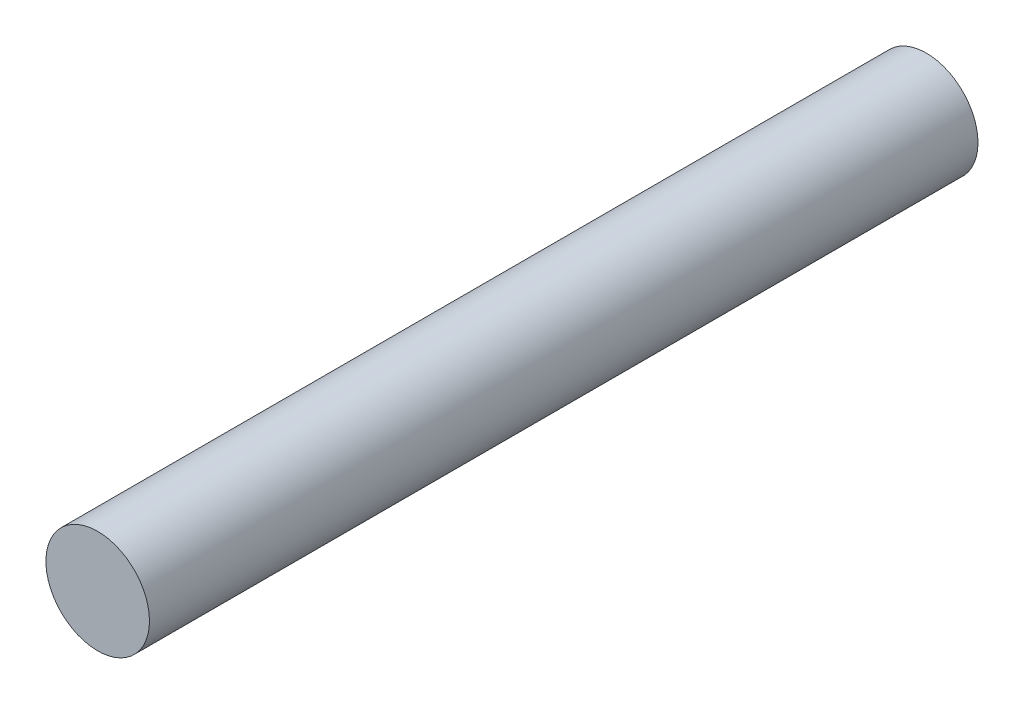
ISO-10303-21;
HEADER;
FILE_DESCRIPTION(('STEP AP214'),'2;1');
FILE_NAME('part.step','',(''),(''),'','','');
FILE_SCHEMA(('AUTOMOTIVE_DESIGN { 1 0 10303 214 1 1 1 1 }'));
ENDSEC;
DATA;
#1=APPLICATION_CONTEXT('core data for automotive mechanical design processes');
#2=APPLICATION_PROTOCOL_DEFINITION('international standard','automotive_design',2000,#1);
#3=PRODUCT_CONTEXT('',#1,'mechanical');
#4=PRODUCT('Part','Part','',(#3));
#5=PRODUCT_RELATED_PRODUCT_CATEGORY('part','',(#4));
#6=PRODUCT_DEFINITION_FORMATION('','',#4);
#7=PRODUCT_DEFINITION_CONTEXT('part definition',#1,'design');
#8=PRODUCT_DEFINITION('design','',#6,#7);
#9=PRODUCT_DEFINITION_SHAPE('','',#8);
#10=(LENGTH_UNIT() NAMED_UNIT(*) SI_UNIT(.MILLI.,.METRE.));
#11=(NAMED_UNIT(*) PLANE_ANGLE_UNIT() SI_UNIT($,.RADIAN.));
#12=(NAMED_UNIT(*) SI_UNIT($,.STERADIAN.) SOLID_ANGLE_UNIT());
#13=UNCERTAINTY_MEASURE_WITH_UNIT(LENGTH_MEASURE(1.E-05),#10,'distance_accuracy_value','');
#14=(GEOMETRIC_REPRESENTATION_CONTEXT(3) GLOBAL_UNCERTAINTY_ASSIGNED_CONTEXT((#13)) GLOBAL_UNIT_ASSIGNED_CONTEXT((#10,
#11,#12)) REPRESENTATION_CONTEXT('',''));
#15=CARTESIAN_POINT('',(0.,0.,0.));
#16=DIRECTION('',(0.,0.,1.));
#17=DIRECTION('',(1.,0.,0.));
#18=AXIS2_PLACEMENT_3D('',#15,#16,#17);
#19=CARTESIAN_POINT('',(0.,0.,-76.2));
#20=DIRECTION('',(0.,0.,1.));
#21=DIRECTION('',(1.,0.,0.));
#22=AXIS2_PLACEMENT_3D('',#19,#20,#21);
#23=CYLINDRICAL_SURFACE('',#22,4.7625);
#24=CARTESIAN_POINT('',(0.,0.,-76.2));
#25=DIRECTION('',(0.,0.,1.));
#26=DIRECTION('',(1.,0.,0.));
#27=AXIS2_PLACEMENT_3D('',#24,#25,#26);
#28=CIRCLE('',#27,4.7625);
#29=CARTESIAN_POINT('',(4.7625,0.,-76.2));
#30=VERTEX_POINT('',#29);
#31=EDGE_CURVE('E10',#30,#30,#28,.T.);
#32=ORIENTED_EDGE('',*,*,#31,.T.);
#33=EDGE_LOOP('',(#32));
#34=FACE_BOUND('',#33,.T.);
#35=CARTESIAN_POINT('',(0.,0.,0.));
#36=DIRECTION('',(0.,0.,1.));
#37=DIRECTION('',(1.,0.,0.));
#38=AXIS2_PLACEMENT_3D('',#35,#36,#37);
#39=CIRCLE('',#38,4.7625);
#40=CARTESIAN_POINT('',(4.7625,0.,0.));
#41=VERTEX_POINT('',#40);
#42=EDGE_CURVE('E40',#41,#41,#39,.T.);
#43=ORIENTED_EDGE('',*,*,#42,.F.);
#44=EDGE_LOOP('',(#43));
#45=FACE_BOUND('',#44,.T.);
#46=ADVANCED_FACE('F37',(#34,#45),#23,.T.);
#47=CARTESIAN_POINT('',(0.,0.,-76.2));
#48=DIRECTION('',(0.,0.,1.));
#49=DIRECTION('',(1.,0.,0.));
#50=AXIS2_PLACEMENT_3D('',#47,#48,#49);
#51=PLANE('',#50);
#52=ORIENTED_EDGE('',*,*,#31,.F.);
#53=EDGE_LOOP('',(#52));
#54=FACE_BOUND('',#53,.T.);
#55=ADVANCED_FACE('F54',(#54),#51,.F.);
#56=CARTESIAN_POINT('',(0.,0.,0.));
#57=DIRECTION('',(0.,0.,1.));
#58=DIRECTION('',(1.,0.,0.));
#59=AXIS2_PLACEMENT_3D('',#56,#57,#58);
#60=PLANE('',#59);
#61=ORIENTED_EDGE('',*,*,#42,.T.);
#62=EDGE_LOOP('',(#61));
#63=FACE_BOUND('',#62,.T.);
#64=ADVANCED_FACE('F51',(#63),#60,.T.);
#65=CLOSED_SHELL('',(#46,#55,#64));
#66=MANIFOLD_SOLID_BREP('B2',#65);
#67=ADVANCED_BREP_SHAPE_REPRESENTATION('',(#18,#66),#14);
#68=SHAPE_DEFINITION_REPRESENTATION(#9,#67);
ENDSEC;
END-ISO-10303-21;
